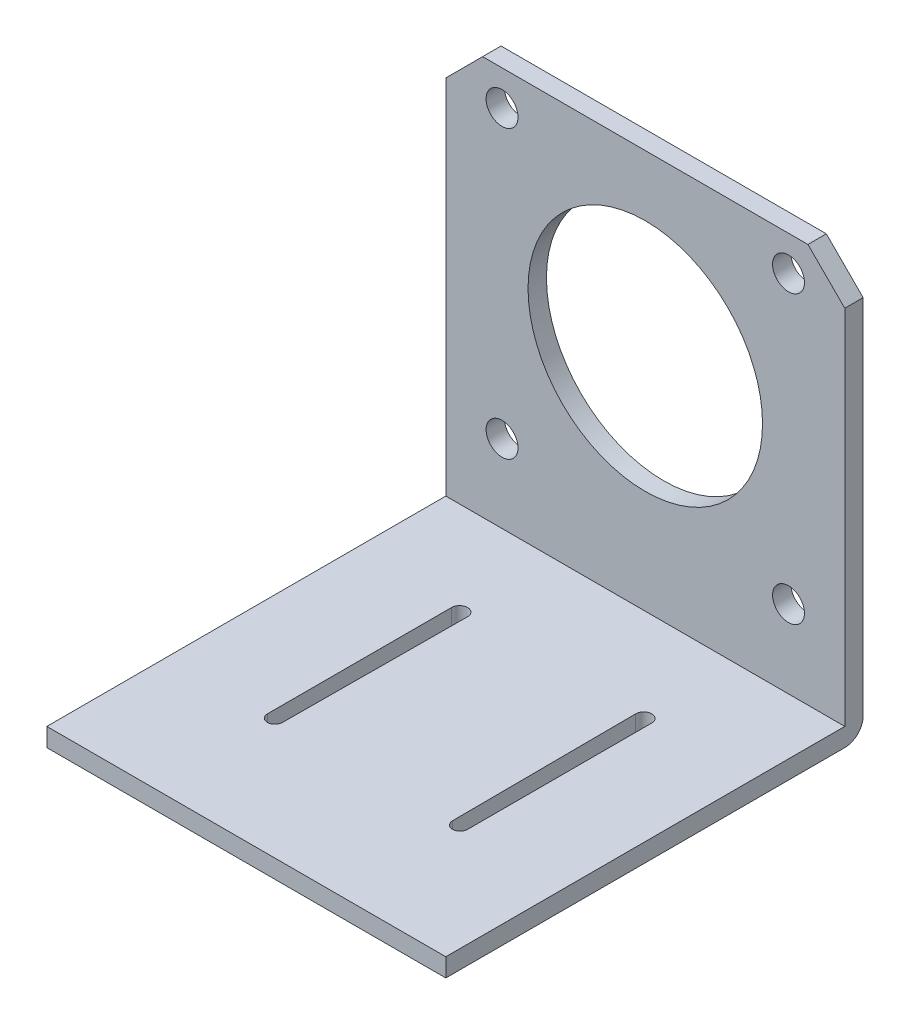
ISO-10303-21;
HEADER;
FILE_DESCRIPTION(('STEP AP214'),'2;1');
FILE_NAME('part.step','',(''),(''),'','','');
FILE_SCHEMA(('AUTOMOTIVE_DESIGN { 1 0 10303 214 1 1 1 1 }'));
ENDSEC;
DATA;
#1=APPLICATION_CONTEXT('core data for automotive mechanical design processes');
#2=APPLICATION_PROTOCOL_DEFINITION('international standard','automotive_design',2000,#1);
#3=PRODUCT_CONTEXT('',#1,'mechanical');
#4=PRODUCT('Part','Part','',(#3));
#5=PRODUCT_RELATED_PRODUCT_CATEGORY('part','',(#4));
#6=PRODUCT_DEFINITION_FORMATION('','',#4);
#7=PRODUCT_DEFINITION_CONTEXT('part definition',#1,'design');
#8=PRODUCT_DEFINITION('design','',#6,#7);
#9=PRODUCT_DEFINITION_SHAPE('','',#8);
#10=(LENGTH_UNIT() NAMED_UNIT(*) SI_UNIT(.MILLI.,.METRE.));
#11=(NAMED_UNIT(*) PLANE_ANGLE_UNIT() SI_UNIT($,.RADIAN.));
#12=(NAMED_UNIT(*) SI_UNIT($,.STERADIAN.) SOLID_ANGLE_UNIT());
#13=UNCERTAINTY_MEASURE_WITH_UNIT(LENGTH_MEASURE(1.E-05),#10,'distance_accuracy_value','');
#14=(GEOMETRIC_REPRESENTATION_CONTEXT(3) GLOBAL_UNCERTAINTY_ASSIGNED_CONTEXT((#13)) GLOBAL_UNIT_ASSIGNED_CONTEXT((#10,
#11,#12)) REPRESENTATION_CONTEXT('',''));
#15=CARTESIAN_POINT('',(0.,0.,0.));
#16=DIRECTION('',(0.,0.,1.));
#17=DIRECTION('',(1.,0.,0.));
#18=AXIS2_PLACEMENT_3D('',#15,#16,#17);
#19=CARTESIAN_POINT('',(-32.5,0.,-4.));
#20=DIRECTION('',(0.,1.,0.));
#21=DIRECTION('',(0.,0.,1.));
#22=AXIS2_PLACEMENT_3D('',#19,#20,#21);
#23=PLANE('',#22);
#24=DIRECTION('',(0.,0.,1.));
#25=VECTOR('',#24,1.);
#26=CARTESIAN_POINT('',(-16.3045351550092,0.,0.));
#27=LINE('',#26,#25);
#28=CARTESIAN_POINT('',(-16.3045351550092,0.,11.2535739083416));
#29=VERTEX_POINT('',#28);
#30=CARTESIAN_POINT('',(-16.3045351550092,0.,41.2535739083416));
#31=VERTEX_POINT('',#30);
#32=EDGE_CURVE('E51',#29,#31,#27,.T.);
#33=ORIENTED_EDGE('',*,*,#32,.F.);
#34=CARTESIAN_POINT('',(-15.,0.,11.2535739083416));
#35=DIRECTION('',(0.,1.,0.));
#36=DIRECTION('',(0.,0.,1.));
#37=AXIS2_PLACEMENT_3D('',#34,#35,#36);
#38=CIRCLE('',#37,1.30453515500922);
#39=CARTESIAN_POINT('',(-13.6954648449908,0.,11.2535739083416));
#40=VERTEX_POINT('',#39);
#41=EDGE_CURVE('E177',#40,#29,#38,.T.);
#42=ORIENTED_EDGE('',*,*,#41,.F.);
#43=DIRECTION('',(-0.00557165884833566,0.,0.999984478188376));
#44=VECTOR('',#43,1.);
#45=CARTESIAN_POINT('',(-13.632339590032,0.,-0.0759559244738696));
#46=LINE('',#45,#44);
#47=CARTESIAN_POINT('',(-13.8626172049483,0.,41.2535739083416));
#48=VERTEX_POINT('',#47);
#49=EDGE_CURVE('E161',#40,#48,#46,.T.);
#50=ORIENTED_EDGE('',*,*,#49,.T.);
#51=CARTESIAN_POINT('',(-15.0835761799788,0.,41.2535739083416));
#52=DIRECTION('',(0.,1.,0.));
#53=DIRECTION('',(0.,0.,1.));
#54=AXIS2_PLACEMENT_3D('',#51,#52,#53);
#55=CIRCLE('',#54,1.22095897503046);
#56=EDGE_CURVE('E171',#31,#48,#55,.T.);
#57=ORIENTED_EDGE('',*,*,#56,.F.);
#58=EDGE_LOOP('',(#33,#42,#50,#57));
#59=FACE_BOUND('',#58,.T.);
#60=DIRECTION('',(1.,0.,0.));
#61=VECTOR('',#60,1.);
#62=CARTESIAN_POINT('',(-32.5,0.,61.));
#63=LINE('',#62,#61);
#64=CARTESIAN_POINT('',(-32.5,0.,61.));
#65=VERTEX_POINT('',#64);
#66=CARTESIAN_POINT('',(32.5,0.,61.));
#67=VERTEX_POINT('',#66);
#68=EDGE_CURVE('E275',#65,#67,#63,.T.);
#69=ORIENTED_EDGE('',*,*,#68,.T.);
#70=DIRECTION('',(0.,0.,1.));
#71=VECTOR('',#70,1.);
#72=CARTESIAN_POINT('',(32.5,0.,-4.));
#73=LINE('',#72,#71);
#74=CARTESIAN_POINT('',(32.5,0.,-4.));
#75=VERTEX_POINT('',#74);
#76=EDGE_CURVE('E247',#75,#67,#73,.T.);
#77=ORIENTED_EDGE('',*,*,#76,.F.);
#78=DIRECTION('',(1.,0.,0.));
#79=VECTOR('',#78,1.);
#80=CARTESIAN_POINT('',(-32.5,0.,-4.));
#81=LINE('',#80,#79);
#82=CARTESIAN_POINT('',(-32.5,0.,-4.));
#83=VERTEX_POINT('',#82);
#84=EDGE_CURVE('E276',#83,#75,#81,.T.);
#85=ORIENTED_EDGE('',*,*,#84,.F.);
#86=DIRECTION('',(0.,0.,1.));
#87=VECTOR('',#86,1.);
#88=CARTESIAN_POINT('',(-32.5,0.,-4.));
#89=LINE('',#88,#87);
#90=EDGE_CURVE('E261',#83,#65,#89,.T.);
#91=ORIENTED_EDGE('',*,*,#90,.T.);
#92=EDGE_LOOP('',(#69,#77,#85,#91));
#93=FACE_BOUND('',#92,.T.);
#94=DIRECTION('',(0.00557165884833601,0.,0.999984478188376));
#95=VECTOR('',#94,1.);
#96=CARTESIAN_POINT('',(13.632339590032,0.,-0.0759559244738743));
#97=LINE('',#96,#95);
#98=CARTESIAN_POINT('',(13.6954648449908,0.,11.2535739083416));
#99=VERTEX_POINT('',#98);
#100=CARTESIAN_POINT('',(13.8626172049483,0.,41.2535739083416));
#101=VERTEX_POINT('',#100);
#102=EDGE_CURVE('E188',#99,#101,#97,.T.);
#103=ORIENTED_EDGE('',*,*,#102,.F.);
#104=CARTESIAN_POINT('',(15.,0.,11.2535739083416));
#105=DIRECTION('',(0.,1.,0.));
#106=DIRECTION('',(0.,0.,1.));
#107=AXIS2_PLACEMENT_3D('',#104,#105,#106);
#108=CIRCLE('',#107,1.30453515500922);
#109=CARTESIAN_POINT('',(16.3045351550092,0.,11.2535739083416));
#110=VERTEX_POINT('',#109);
#111=EDGE_CURVE('E59',#99,#110,#108,.F.);
#112=ORIENTED_EDGE('',*,*,#111,.T.);
#113=DIRECTION('',(0.,0.,1.));
#114=VECTOR('',#113,1.);
#115=CARTESIAN_POINT('',(16.3045351550092,0.,0.));
#116=LINE('',#115,#114);
#117=CARTESIAN_POINT('',(16.3045351550092,0.,41.2535739083416));
#118=VERTEX_POINT('',#117);
#119=EDGE_CURVE('E194',#110,#118,#116,.T.);
#120=ORIENTED_EDGE('',*,*,#119,.T.);
#121=CARTESIAN_POINT('',(15.0835761799788,0.,41.2535739083416));
#122=DIRECTION('',(0.,1.,0.));
#123=DIRECTION('',(0.,0.,1.));
#124=AXIS2_PLACEMENT_3D('',#121,#122,#123);
#125=CIRCLE('',#124,1.22095897503046);
#126=EDGE_CURVE('E191',#118,#101,#125,.F.);
#127=ORIENTED_EDGE('',*,*,#126,.T.);
#128=EDGE_LOOP('',(#103,#112,#120,#127));
#129=FACE_BOUND('',#128,.T.);
#130=ADVANCED_FACE('F36',(#59,#93,#129),#23,.T.);
#131=CARTESIAN_POINT('',(-32.5,-3.,-7.));
#132=DIRECTION('',(0.,-1.,0.));
#133=DIRECTION('',(0.,0.,-1.));
#134=AXIS2_PLACEMENT_3D('',#131,#132,#133);
#135=PLANE('',#134);
#136=DIRECTION('',(0.,0.,-1.));
#137=VECTOR('',#136,1.);
#138=CARTESIAN_POINT('',(-16.3045351550092,-3.,-7.));
#139=LINE('',#138,#137);
#140=CARTESIAN_POINT('',(-16.3045351550092,-3.00000000000001,41.2535739083416));
#141=VERTEX_POINT('',#140);
#142=CARTESIAN_POINT('',(-16.3045351550092,-3.,11.2535739083416));
#143=VERTEX_POINT('',#142);
#144=EDGE_CURVE('E12',#141,#143,#139,.T.);
#145=ORIENTED_EDGE('',*,*,#144,.F.);
#146=CARTESIAN_POINT('',(-15.0835761799788,-3.00000000000001,41.2535739083416));
#147=DIRECTION('',(0.,-1.,0.));
#148=DIRECTION('',(0.,0.,-1.));
#149=AXIS2_PLACEMENT_3D('',#146,#147,#148);
#150=CIRCLE('',#149,1.22095897503046);
#151=CARTESIAN_POINT('',(-13.8626172049483,-3.00000000000001,41.2535739083416));
#152=VERTEX_POINT('',#151);
#153=EDGE_CURVE('E313',#152,#141,#150,.T.);
#154=ORIENTED_EDGE('',*,*,#153,.F.);
#155=DIRECTION('',(0.00557165884833566,0.,-0.999984478188376));
#156=VECTOR('',#155,1.);
#157=CARTESIAN_POINT('',(-13.5943474933948,-3.,-6.89466251889947));
#158=LINE('',#157,#156);
#159=CARTESIAN_POINT('',(-13.6954648449908,-3.,11.2535739083416));
#160=VERTEX_POINT('',#159);
#161=EDGE_CURVE('E164',#152,#160,#158,.T.);
#162=ORIENTED_EDGE('',*,*,#161,.T.);
#163=CARTESIAN_POINT('',(-15.,-3.,11.2535739083416));
#164=DIRECTION('',(0.,-1.,0.));
#165=DIRECTION('',(0.,0.,-1.));
#166=AXIS2_PLACEMENT_3D('',#163,#164,#165);
#167=CIRCLE('',#166,1.30453515500922);
#168=EDGE_CURVE('E44',#143,#160,#167,.T.);
#169=ORIENTED_EDGE('',*,*,#168,.F.);
#170=EDGE_LOOP('',(#145,#154,#162,#169));
#171=FACE_BOUND('',#170,.T.);
#172=DIRECTION('',(0.,0.,-1.));
#173=VECTOR('',#172,1.);
#174=CARTESIAN_POINT('',(-32.5,-3.,-7.));
#175=LINE('',#174,#173);
#176=CARTESIAN_POINT('',(-32.5,-3.00000000000001,61.));
#177=VERTEX_POINT('',#176);
#178=CARTESIAN_POINT('',(-32.5,-3.,-4.));
#179=VERTEX_POINT('',#178);
#180=EDGE_CURVE('E267',#177,#179,#175,.T.);
#181=ORIENTED_EDGE('',*,*,#180,.T.);
#182=DIRECTION('',(1.,0.,0.));
#183=VECTOR('',#182,1.);
#184=CARTESIAN_POINT('',(-32.5,-3.,-4.));
#185=LINE('',#184,#183);
#186=CARTESIAN_POINT('',(32.5,-3.,-4.));
#187=VERTEX_POINT('',#186);
#188=EDGE_CURVE('E279',#179,#187,#185,.T.);
#189=ORIENTED_EDGE('',*,*,#188,.T.);
#190=DIRECTION('',(0.,0.,-1.));
#191=VECTOR('',#190,1.);
#192=CARTESIAN_POINT('',(32.5,-3.,-7.));
#193=LINE('',#192,#191);
#194=CARTESIAN_POINT('',(32.5,-3.00000000000001,61.));
#195=VERTEX_POINT('',#194);
#196=EDGE_CURVE('E253',#195,#187,#193,.T.);
#197=ORIENTED_EDGE('',*,*,#196,.F.);
#198=DIRECTION('',(1.,0.,0.));
#199=VECTOR('',#198,1.);
#200=CARTESIAN_POINT('',(-32.5,-3.00000000000001,61.));
#201=LINE('',#200,#199);
#202=EDGE_CURVE('E286',#177,#195,#201,.T.);
#203=ORIENTED_EDGE('',*,*,#202,.F.);
#204=EDGE_LOOP('',(#181,#189,#197,#203));
#205=FACE_BOUND('',#204,.T.);
#206=DIRECTION('',(0.,0.,-1.));
#207=VECTOR('',#206,1.);
#208=CARTESIAN_POINT('',(16.3045351550092,-3.,-7.));
#209=LINE('',#208,#207);
#210=CARTESIAN_POINT('',(16.3045351550092,-3.00000000000001,41.2535739083416));
#211=VERTEX_POINT('',#210);
#212=CARTESIAN_POINT('',(16.3045351550092,-3.,11.2535739083416));
#213=VERTEX_POINT('',#212);
#214=EDGE_CURVE('E307',#211,#213,#209,.T.);
#215=ORIENTED_EDGE('',*,*,#214,.T.);
#216=CARTESIAN_POINT('',(15.,-3.,11.2535739083416));
#217=DIRECTION('',(0.,-1.,0.));
#218=DIRECTION('',(0.,0.,-1.));
#219=AXIS2_PLACEMENT_3D('',#216,#217,#218);
#220=CIRCLE('',#219,1.30453515500922);
#221=CARTESIAN_POINT('',(13.6954648449908,-3.,11.2535739083416));
#222=VERTEX_POINT('',#221);
#223=EDGE_CURVE('E310',#213,#222,#220,.F.);
#224=ORIENTED_EDGE('',*,*,#223,.T.);
#225=DIRECTION('',(-0.00557165884833601,0.,-0.999984478188376));
#226=VECTOR('',#225,1.);
#227=CARTESIAN_POINT('',(13.5923296735438,-3.,-7.25681472269577));
#228=LINE('',#227,#226);
#229=CARTESIAN_POINT('',(13.8626172049483,-3.00000000000001,41.2535739083416));
#230=VERTEX_POINT('',#229);
#231=EDGE_CURVE('E302',#230,#222,#228,.T.);
#232=ORIENTED_EDGE('',*,*,#231,.F.);
#233=CARTESIAN_POINT('',(15.0835761799788,-3.00000000000001,41.2535739083416));
#234=DIRECTION('',(0.,-1.,0.));
#235=DIRECTION('',(0.,0.,-1.));
#236=AXIS2_PLACEMENT_3D('',#233,#234,#235);
#237=CIRCLE('',#236,1.22095897503046);
#238=EDGE_CURVE('E304',#230,#211,#237,.F.);
#239=ORIENTED_EDGE('',*,*,#238,.T.);
#240=EDGE_LOOP('',(#215,#224,#232,#239));
#241=FACE_BOUND('',#240,.T.);
#242=ADVANCED_FACE('F321',(#171,#205,#241),#135,.T.);
#243=CARTESIAN_POINT('',(-32.5,65.,-3.99999999999999));
#244=DIRECTION('',(0.,0.,1.));
#245=DIRECTION('',(0.,-1.,0.));
#246=AXIS2_PLACEMENT_3D('',#243,#244,#245);
#247=PLANE('',#246);
#248=CARTESIAN_POINT('',(23.3345237791557,12.6654762208442,-4.));
#249=DIRECTION('',(0.,0.,1.));
#250=DIRECTION('',(0.,-1.,0.));
#251=AXIS2_PLACEMENT_3D('',#248,#249,#250);
#252=CIRCLE('',#251,2.6);
#253=CARTESIAN_POINT('',(23.3345237791557,10.0654762208442,-4.));
#254=VERTEX_POINT('',#253);
#255=EDGE_CURVE('E244',#254,#254,#252,.T.);
#256=ORIENTED_EDGE('',*,*,#255,.F.);
#257=EDGE_LOOP('',(#256));
#258=FACE_BOUND('',#257,.T.);
#259=CARTESIAN_POINT('',(-23.3345237791565,12.6654762208444,-4.));
#260=DIRECTION('',(0.,0.,1.));
#261=DIRECTION('',(0.,-1.,0.));
#262=AXIS2_PLACEMENT_3D('',#259,#260,#261);
#263=CIRCLE('',#262,2.6);
#264=CARTESIAN_POINT('',(-23.3345237791565,10.0654762208444,-4.));
#265=VERTEX_POINT('',#264);
#266=EDGE_CURVE('E241',#265,#265,#263,.T.);
#267=ORIENTED_EDGE('',*,*,#266,.F.);
#268=EDGE_LOOP('',(#267));
#269=FACE_BOUND('',#268,.T.);
#270=CARTESIAN_POINT('',(-23.3345237791562,59.3345237791566,-3.99999999999999));
#271=DIRECTION('',(0.,0.,1.));
#272=DIRECTION('',(0.,-1.,0.));
#273=AXIS2_PLACEMENT_3D('',#270,#271,#272);
#274=CIRCLE('',#273,2.6);
#275=CARTESIAN_POINT('',(-23.3345237791562,56.7345237791566,-3.99999999999999));
#276=VERTEX_POINT('',#275);
#277=EDGE_CURVE('E238',#276,#276,#274,.T.);
#278=ORIENTED_EDGE('',*,*,#277,.F.);
#279=EDGE_LOOP('',(#278));
#280=FACE_BOUND('',#279,.T.);
#281=DIRECTION('',(0.707106781186548,0.707106781186548,0.));
#282=VECTOR('',#281,1.);
#283=CARTESIAN_POINT('',(-29.5,62.,-3.99999999999999));
#284=LINE('',#283,#282);
#285=CARTESIAN_POINT('',(-32.5,59.,-4.));
#286=VERTEX_POINT('',#285);
#287=CARTESIAN_POINT('',(-26.5,65.,-3.99999999999999));
#288=VERTEX_POINT('',#287);
#289=EDGE_CURVE('E230',#286,#288,#284,.T.);
#290=ORIENTED_EDGE('',*,*,#289,.F.);
#291=DIRECTION('',(0.,-1.,0.));
#292=VECTOR('',#291,1.);
#293=CARTESIAN_POINT('',(-32.5,65.,-3.99999999999999));
#294=LINE('',#293,#292);
#295=EDGE_CURVE('E273',#286,#83,#294,.T.);
#296=ORIENTED_EDGE('',*,*,#295,.T.);
#297=ORIENTED_EDGE('',*,*,#84,.T.);
#298=DIRECTION('',(0.,-1.,0.));
#299=VECTOR('',#298,1.);
#300=CARTESIAN_POINT('',(32.5,65.,-3.99999999999999));
#301=LINE('',#300,#299);
#302=CARTESIAN_POINT('',(32.5,59.,-3.99999999999999));
#303=VERTEX_POINT('',#302);
#304=EDGE_CURVE('E259',#303,#75,#301,.T.);
#305=ORIENTED_EDGE('',*,*,#304,.F.);
#306=DIRECTION('',(0.707106781186548,-0.707106781186548,0.));
#307=VECTOR('',#306,1.);
#308=CARTESIAN_POINT('',(-3.,94.5,-3.99999999999999));
#309=LINE('',#308,#307);
#310=CARTESIAN_POINT('',(26.5,65.,-3.99999999999999));
#311=VERTEX_POINT('',#310);
#312=EDGE_CURVE('E228',#311,#303,#309,.T.);
#313=ORIENTED_EDGE('',*,*,#312,.F.);
#314=DIRECTION('',(1.,0.,0.));
#315=VECTOR('',#314,1.);
#316=CARTESIAN_POINT('',(-32.5,65.,-3.99999999999999));
#317=LINE('',#316,#315);
#318=EDGE_CURVE('E280',#288,#311,#317,.T.);
#319=ORIENTED_EDGE('',*,*,#318,.F.);
#320=EDGE_LOOP('',(#290,#296,#297,#305,#313,#319));
#321=FACE_BOUND('',#320,.T.);
#322=CARTESIAN_POINT('',(23.334523779156,59.3345237791561,-3.99999999999999));
#323=DIRECTION('',(0.,0.,1.));
#324=DIRECTION('',(0.,-1.,0.));
#325=AXIS2_PLACEMENT_3D('',#322,#323,#324);
#326=CIRCLE('',#325,2.6);
#327=CARTESIAN_POINT('',(23.334523779156,56.7345237791561,-3.99999999999999));
#328=VERTEX_POINT('',#327);
#329=EDGE_CURVE('E235',#328,#328,#326,.T.);
#330=ORIENTED_EDGE('',*,*,#329,.F.);
#331=EDGE_LOOP('',(#330));
#332=FACE_BOUND('',#331,.T.);
#333=CARTESIAN_POINT('',(0.,36.,-3.99999999999999));
#334=DIRECTION('',(0.,0.,1.));
#335=DIRECTION('',(0.,-1.,0.));
#336=AXIS2_PLACEMENT_3D('',#333,#334,#335);
#337=CIRCLE('',#336,19.1);
#338=CARTESIAN_POINT('',(0.,16.9,-4.));
#339=VERTEX_POINT('',#338);
#340=EDGE_CURVE('E232',#339,#339,#337,.T.);
#341=ORIENTED_EDGE('',*,*,#340,.F.);
#342=EDGE_LOOP('',(#341));
#343=FACE_BOUND('',#342,.T.);
#344=ADVANCED_FACE('F341',(#258,#269,#280,#321,#332,#343),#247,.T.);
#345=CARTESIAN_POINT('',(-32.5,65.,-6.99999999999999));
#346=DIRECTION('',(0.,1.,0.));
#347=DIRECTION('',(0.,0.,1.));
#348=AXIS2_PLACEMENT_3D('',#345,#346,#347);
#349=PLANE('',#348);
#350=DIRECTION('',(0.,0.,-1.));
#351=VECTOR('',#350,1.);
#352=CARTESIAN_POINT('',(-26.5,65.,6.12500000000001));
#353=LINE('',#352,#351);
#354=CARTESIAN_POINT('',(-26.5,65.,-6.99999999999999));
#355=VERTEX_POINT('',#354);
#356=EDGE_CURVE('E212',#288,#355,#353,.T.);
#357=ORIENTED_EDGE('',*,*,#356,.F.);
#358=ORIENTED_EDGE('',*,*,#318,.T.);
#359=DIRECTION('',(0.,0.,-1.));
#360=VECTOR('',#359,1.);
#361=CARTESIAN_POINT('',(26.5,65.,6.12500000000001));
#362=LINE('',#361,#360);
#363=CARTESIAN_POINT('',(26.5,65.,-6.99999999999999));
#364=VERTEX_POINT('',#363);
#365=EDGE_CURVE('E209',#311,#364,#362,.T.);
#366=ORIENTED_EDGE('',*,*,#365,.T.);
#367=DIRECTION('',(1.,0.,0.));
#368=VECTOR('',#367,1.);
#369=CARTESIAN_POINT('',(-32.5,65.,-6.99999999999999));
#370=LINE('',#369,#368);
#371=EDGE_CURVE('E283',#355,#364,#370,.T.);
#372=ORIENTED_EDGE('',*,*,#371,.F.);
#373=EDGE_LOOP('',(#357,#358,#366,#372));
#374=FACE_BOUND('',#373,.T.);
#375=ADVANCED_FACE('F352',(#374),#349,.T.);
#376=CARTESIAN_POINT('',(-32.5,65.,-6.99999999999999));
#377=DIRECTION('',(0.,0.,-1.));
#378=DIRECTION('',(0.,1.,0.));
#379=AXIS2_PLACEMENT_3D('',#376,#377,#378);
#380=PLANE('',#379);
#381=CARTESIAN_POINT('',(23.3345237791557,12.6654762208442,-7.));
#382=DIRECTION('',(0.,0.,-1.));
#383=DIRECTION('',(0.,1.,0.));
#384=AXIS2_PLACEMENT_3D('',#381,#382,#383);
#385=CIRCLE('',#384,2.6);
#386=CARTESIAN_POINT('',(23.3345237791557,15.2654762208442,-7.));
#387=VERTEX_POINT('',#386);
#388=EDGE_CURVE('E184',#387,#387,#385,.T.);
#389=ORIENTED_EDGE('',*,*,#388,.F.);
#390=EDGE_LOOP('',(#389));
#391=FACE_BOUND('',#390,.T.);
#392=CARTESIAN_POINT('',(-23.3345237791565,12.6654762208444,-7.));
#393=DIRECTION('',(0.,0.,-1.));
#394=DIRECTION('',(0.,1.,0.));
#395=AXIS2_PLACEMENT_3D('',#392,#393,#394);
#396=CIRCLE('',#395,2.6);
#397=CARTESIAN_POINT('',(-23.3345237791565,15.2654762208444,-7.));
#398=VERTEX_POINT('',#397);
#399=EDGE_CURVE('E221',#398,#398,#396,.T.);
#400=ORIENTED_EDGE('',*,*,#399,.F.);
#401=EDGE_LOOP('',(#400));
#402=FACE_BOUND('',#401,.T.);
#403=CARTESIAN_POINT('',(-23.3345237791562,59.3345237791566,-6.99999999999999));
#404=DIRECTION('',(0.,0.,-1.));
#405=DIRECTION('',(0.,1.,0.));
#406=AXIS2_PLACEMENT_3D('',#403,#404,#405);
#407=CIRCLE('',#406,2.6);
#408=CARTESIAN_POINT('',(-23.3345237791562,61.9345237791566,-6.99999999999999));
#409=VERTEX_POINT('',#408);
#410=EDGE_CURVE('E217',#409,#409,#407,.T.);
#411=ORIENTED_EDGE('',*,*,#410,.F.);
#412=EDGE_LOOP('',(#411));
#413=FACE_BOUND('',#412,.T.);
#414=DIRECTION('',(-0.707106781186548,-0.707106781186548,0.));
#415=VECTOR('',#414,1.);
#416=CARTESIAN_POINT('',(-26.5,65.,-6.99999999999999));
#417=LINE('',#416,#415);
#418=CARTESIAN_POINT('',(-32.5,59.,-6.99999999999999));
#419=VERTEX_POINT('',#418);
#420=EDGE_CURVE('E215',#355,#419,#417,.T.);
#421=ORIENTED_EDGE('',*,*,#420,.F.);
#422=ORIENTED_EDGE('',*,*,#371,.T.);
#423=DIRECTION('',(-0.707106781186548,0.707106781186548,0.));
#424=VECTOR('',#423,1.);
#425=CARTESIAN_POINT('',(26.5,65.,-6.99999999999999));
#426=LINE('',#425,#424);
#427=CARTESIAN_POINT('',(32.5,59.,-6.99999999999999));
#428=VERTEX_POINT('',#427);
#429=EDGE_CURVE('E210',#428,#364,#426,.T.);
#430=ORIENTED_EDGE('',*,*,#429,.F.);
#431=DIRECTION('',(0.,1.,0.));
#432=VECTOR('',#431,1.);
#433=CARTESIAN_POINT('',(32.5,65.,-6.99999999999999));
#434=LINE('',#433,#432);
#435=CARTESIAN_POINT('',(32.5,0.,-7.));
#436=VERTEX_POINT('',#435);
#437=EDGE_CURVE('E256',#436,#428,#434,.T.);
#438=ORIENTED_EDGE('',*,*,#437,.F.);
#439=DIRECTION('',(1.,0.,0.));
#440=VECTOR('',#439,1.);
#441=CARTESIAN_POINT('',(-32.5,0.,-7.));
#442=LINE('',#441,#440);
#443=CARTESIAN_POINT('',(-32.5,0.,-7.));
#444=VERTEX_POINT('',#443);
#445=EDGE_CURVE('E293',#436,#444,#442,.F.);
#446=ORIENTED_EDGE('',*,*,#445,.T.);
#447=DIRECTION('',(0.,1.,0.));
#448=VECTOR('',#447,1.);
#449=CARTESIAN_POINT('',(-32.5,65.,-6.99999999999999));
#450=LINE('',#449,#448);
#451=EDGE_CURVE('E270',#444,#419,#450,.T.);
#452=ORIENTED_EDGE('',*,*,#451,.T.);
#453=EDGE_LOOP('',(#421,#422,#430,#438,#446,#452));
#454=FACE_BOUND('',#453,.T.);
#455=CARTESIAN_POINT('',(23.334523779156,59.3345237791561,-6.99999999999999));
#456=DIRECTION('',(0.,0.,-1.));
#457=DIRECTION('',(0.,1.,0.));
#458=AXIS2_PLACEMENT_3D('',#455,#456,#457);
#459=CIRCLE('',#458,2.6);
#460=CARTESIAN_POINT('',(23.334523779156,61.9345237791561,-6.99999999999999));
#461=VERTEX_POINT('',#460);
#462=EDGE_CURVE('E205',#461,#461,#459,.T.);
#463=ORIENTED_EDGE('',*,*,#462,.F.);
#464=EDGE_LOOP('',(#463));
#465=FACE_BOUND('',#464,.T.);
#466=CARTESIAN_POINT('',(0.,36.,-7.));
#467=DIRECTION('',(0.,0.,-1.));
#468=DIRECTION('',(0.,1.,0.));
#469=AXIS2_PLACEMENT_3D('',#466,#467,#468);
#470=CIRCLE('',#469,19.1);
#471=CARTESIAN_POINT('',(0.,55.1,-6.99999999999999));
#472=VERTEX_POINT('',#471);
#473=EDGE_CURVE('E208',#472,#472,#470,.T.);
#474=ORIENTED_EDGE('',*,*,#473,.F.);
#475=EDGE_LOOP('',(#474));
#476=FACE_BOUND('',#475,.T.);
#477=ADVANCED_FACE('F347',(#391,#402,#413,#454,#465,#476),#380,.T.);
#478=CARTESIAN_POINT('',(-32.5,-3.00000000000001,61.));
#479=DIRECTION('',(0.,0.,1.));
#480=DIRECTION('',(1.,0.,0.));
#481=AXIS2_PLACEMENT_3D('',#478,#479,#480);
#482=PLANE('',#481);
#483=ORIENTED_EDGE('',*,*,#202,.T.);
#484=DIRECTION('',(0.,-1.,0.));
#485=VECTOR('',#484,1.);
#486=CARTESIAN_POINT('',(32.5,-3.00000000000001,61.));
#487=LINE('',#486,#485);
#488=EDGE_CURVE('E250',#67,#195,#487,.T.);
#489=ORIENTED_EDGE('',*,*,#488,.F.);
#490=ORIENTED_EDGE('',*,*,#68,.F.);
#491=DIRECTION('',(0.,-1.,0.));
#492=VECTOR('',#491,1.);
#493=CARTESIAN_POINT('',(-32.5,-3.00000000000001,61.));
#494=LINE('',#493,#492);
#495=EDGE_CURVE('E264',#65,#177,#494,.T.);
#496=ORIENTED_EDGE('',*,*,#495,.T.);
#497=EDGE_LOOP('',(#483,#489,#490,#496));
#498=FACE_BOUND('',#497,.T.);
#499=ADVANCED_FACE('F344',(#498),#482,.T.);
#500=CARTESIAN_POINT('',(-32.5,0.,0.));
#501=DIRECTION('',(-1.,0.,0.));
#502=DIRECTION('',(0.,0.,1.));
#503=AXIS2_PLACEMENT_3D('',#500,#501,#502);
#504=PLANE('',#503);
#505=DIRECTION('',(0.,0.,1.));
#506=VECTOR('',#505,1.);
#507=CARTESIAN_POINT('',(-32.5,59.,0.));
#508=LINE('',#507,#506);
#509=EDGE_CURVE('E300',#419,#286,#508,.T.);
#510=ORIENTED_EDGE('',*,*,#509,.F.);
#511=ORIENTED_EDGE('',*,*,#451,.F.);
#512=CARTESIAN_POINT('',(-32.5,0.,-4.));
#513=DIRECTION('',(-1.,0.,0.));
#514=DIRECTION('',(0.,0.,1.));
#515=AXIS2_PLACEMENT_3D('',#512,#513,#514);
#516=CIRCLE('',#515,3.);
#517=EDGE_CURVE('E295',#444,#179,#516,.T.);
#518=ORIENTED_EDGE('',*,*,#517,.T.);
#519=ORIENTED_EDGE('',*,*,#180,.F.);
#520=ORIENTED_EDGE('',*,*,#495,.F.);
#521=ORIENTED_EDGE('',*,*,#90,.F.);
#522=ORIENTED_EDGE('',*,*,#295,.F.);
#523=EDGE_LOOP('',(#510,#511,#518,#519,#520,#521,#522));
#524=FACE_BOUND('',#523,.T.);
#525=ADVANCED_FACE('F346',(#524),#504,.T.);
#526=CARTESIAN_POINT('',(32.5,0.,0.));
#527=DIRECTION('',(-1.,0.,0.));
#528=DIRECTION('',(0.,0.,1.));
#529=AXIS2_PLACEMENT_3D('',#526,#527,#528);
#530=PLANE('',#529);
#531=ORIENTED_EDGE('',*,*,#437,.T.);
#532=DIRECTION('',(0.,0.,1.));
#533=VECTOR('',#532,1.);
#534=CARTESIAN_POINT('',(32.5,59.,0.));
#535=LINE('',#534,#533);
#536=EDGE_CURVE('E297',#428,#303,#535,.T.);
#537=ORIENTED_EDGE('',*,*,#536,.T.);
#538=ORIENTED_EDGE('',*,*,#304,.T.);
#539=ORIENTED_EDGE('',*,*,#76,.T.);
#540=ORIENTED_EDGE('',*,*,#488,.T.);
#541=ORIENTED_EDGE('',*,*,#196,.T.);
#542=CARTESIAN_POINT('',(32.5,0.,-4.));
#543=DIRECTION('',(-1.,0.,0.));
#544=DIRECTION('',(0.,0.,1.));
#545=AXIS2_PLACEMENT_3D('',#542,#543,#544);
#546=CIRCLE('',#545,3.);
#547=EDGE_CURVE('E291',#187,#436,#546,.F.);
#548=ORIENTED_EDGE('',*,*,#547,.T.);
#549=EDGE_LOOP('',(#531,#537,#538,#539,#540,#541,#548));
#550=FACE_BOUND('',#549,.T.);
#551=ADVANCED_FACE('F362',(#550),#530,.F.);
#552=CARTESIAN_POINT('',(-32.5,0.,-4.));
#553=DIRECTION('',(1.,0.,0.));
#554=DIRECTION('',(0.,0.,-1.));
#555=AXIS2_PLACEMENT_3D('',#552,#553,#554);
#556=CYLINDRICAL_SURFACE('',#555,3.);
#557=ORIENTED_EDGE('',*,*,#517,.F.);
#558=ORIENTED_EDGE('',*,*,#445,.F.);
#559=ORIENTED_EDGE('',*,*,#547,.F.);
#560=ORIENTED_EDGE('',*,*,#188,.F.);
#561=EDGE_LOOP('',(#557,#558,#559,#560));
#562=FACE_BOUND('',#561,.T.);
#563=ADVANCED_FACE('F38',(#562),#556,.T.);
#564=CARTESIAN_POINT('',(26.5,65.,6.12500000000001));
#565=DIRECTION('',(-0.707106781186548,-0.707106781186548,0.));
#566=DIRECTION('',(0.707106781186548,-0.707106781186548,0.));
#567=AXIS2_PLACEMENT_3D('',#564,#565,#566);
#568=PLANE('',#567);
#569=ORIENTED_EDGE('',*,*,#312,.T.);
#570=ORIENTED_EDGE('',*,*,#536,.F.);
#571=ORIENTED_EDGE('',*,*,#429,.T.);
#572=ORIENTED_EDGE('',*,*,#365,.F.);
#573=EDGE_LOOP('',(#569,#570,#571,#572));
#574=FACE_BOUND('',#573,.T.);
#575=ADVANCED_FACE('F388',(#574),#568,.F.);
#576=CARTESIAN_POINT('',(-26.5,65.,6.12500000000001));
#577=DIRECTION('',(0.707106781186548,-0.707106781186548,0.));
#578=DIRECTION('',(0.707106781186548,0.707106781186548,0.));
#579=AXIS2_PLACEMENT_3D('',#576,#577,#578);
#580=PLANE('',#579);
#581=ORIENTED_EDGE('',*,*,#289,.T.);
#582=ORIENTED_EDGE('',*,*,#356,.T.);
#583=ORIENTED_EDGE('',*,*,#420,.T.);
#584=ORIENTED_EDGE('',*,*,#509,.T.);
#585=EDGE_LOOP('',(#581,#582,#583,#584));
#586=FACE_BOUND('',#585,.T.);
#587=ADVANCED_FACE('F371',(#586),#580,.F.);
#588=CARTESIAN_POINT('',(0.,36.,6.125));
#589=DIRECTION('',(0.,0.,-1.));
#590=DIRECTION('',(0.,1.,0.));
#591=AXIS2_PLACEMENT_3D('',#588,#589,#590);
#592=CYLINDRICAL_SURFACE('',#591,19.1);
#593=ORIENTED_EDGE('',*,*,#340,.T.);
#594=EDGE_LOOP('',(#593));
#595=FACE_BOUND('',#594,.T.);
#596=ORIENTED_EDGE('',*,*,#473,.T.);
#597=EDGE_LOOP('',(#596));
#598=FACE_BOUND('',#597,.T.);
#599=ADVANCED_FACE('F367',(#595,#598),#592,.F.);
#600=CARTESIAN_POINT('',(23.334523779156,59.3345237791561,6.12500000000001));
#601=DIRECTION('',(0.,0.,-1.));
#602=DIRECTION('',(0.,1.,0.));
#603=AXIS2_PLACEMENT_3D('',#600,#601,#602);
#604=CYLINDRICAL_SURFACE('',#603,2.6);
#605=ORIENTED_EDGE('',*,*,#329,.T.);
#606=EDGE_LOOP('',(#605));
#607=FACE_BOUND('',#606,.T.);
#608=ORIENTED_EDGE('',*,*,#462,.T.);
#609=EDGE_LOOP('',(#608));
#610=FACE_BOUND('',#609,.T.);
#611=ADVANCED_FACE('F370',(#607,#610),#604,.F.);
#612=CARTESIAN_POINT('',(-23.3345237791562,59.3345237791566,6.12500000000001));
#613=DIRECTION('',(0.,0.,-1.));
#614=DIRECTION('',(0.,1.,0.));
#615=AXIS2_PLACEMENT_3D('',#612,#613,#614);
#616=CYLINDRICAL_SURFACE('',#615,2.6);
#617=ORIENTED_EDGE('',*,*,#277,.T.);
#618=EDGE_LOOP('',(#617));
#619=FACE_BOUND('',#618,.T.);
#620=ORIENTED_EDGE('',*,*,#410,.T.);
#621=EDGE_LOOP('',(#620));
#622=FACE_BOUND('',#621,.T.);
#623=ADVANCED_FACE('F381',(#619,#622),#616,.F.);
#624=CARTESIAN_POINT('',(-23.3345237791565,12.6654762208444,6.125));
#625=DIRECTION('',(0.,0.,-1.));
#626=DIRECTION('',(0.,1.,0.));
#627=AXIS2_PLACEMENT_3D('',#624,#625,#626);
#628=CYLINDRICAL_SURFACE('',#627,2.6);
#629=ORIENTED_EDGE('',*,*,#266,.T.);
#630=EDGE_LOOP('',(#629));
#631=FACE_BOUND('',#630,.T.);
#632=ORIENTED_EDGE('',*,*,#399,.T.);
#633=EDGE_LOOP('',(#632));
#634=FACE_BOUND('',#633,.T.);
#635=ADVANCED_FACE('F377',(#631,#634),#628,.F.);
#636=CARTESIAN_POINT('',(23.3345237791557,12.6654762208442,6.125));
#637=DIRECTION('',(0.,0.,-1.));
#638=DIRECTION('',(0.,1.,0.));
#639=AXIS2_PLACEMENT_3D('',#636,#637,#638);
#640=CYLINDRICAL_SURFACE('',#639,2.6);
#641=ORIENTED_EDGE('',*,*,#255,.T.);
#642=EDGE_LOOP('',(#641));
#643=FACE_BOUND('',#642,.T.);
#644=ORIENTED_EDGE('',*,*,#388,.T.);
#645=EDGE_LOOP('',(#644));
#646=FACE_BOUND('',#645,.T.);
#647=ADVANCED_FACE('F373',(#643,#646),#640,.F.);
#648=CARTESIAN_POINT('',(15.,-10.,11.2535739083416));
#649=DIRECTION('',(0.,1.,0.));
#650=DIRECTION('',(0.,0.,1.));
#651=AXIS2_PLACEMENT_3D('',#648,#649,#650);
#652=CYLINDRICAL_SURFACE('',#651,1.30453515500922);
#653=DIRECTION('',(0.,1.,0.));
#654=VECTOR('',#653,1.);
#655=CARTESIAN_POINT('',(16.3045351550092,-10.,11.2535739083416));
#656=LINE('',#655,#654);
#657=EDGE_CURVE('E198',#213,#110,#656,.T.);
#658=ORIENTED_EDGE('',*,*,#657,.T.);
#659=ORIENTED_EDGE('',*,*,#111,.F.);
#660=DIRECTION('',(0.,1.,0.));
#661=VECTOR('',#660,1.);
#662=CARTESIAN_POINT('',(13.6954648449908,-10.,11.2535739083416));
#663=LINE('',#662,#661);
#664=EDGE_CURVE('E197',#222,#99,#663,.T.);
#665=ORIENTED_EDGE('',*,*,#664,.F.);
#666=ORIENTED_EDGE('',*,*,#223,.F.);
#667=EDGE_LOOP('',(#658,#659,#665,#666));
#668=FACE_BOUND('',#667,.T.);
#669=ADVANCED_FACE('F376',(#668),#652,.F.);
#670=CARTESIAN_POINT('',(16.3045351550092,-10.,0.));
#671=DIRECTION('',(-1.,0.,0.));
#672=DIRECTION('',(0.,0.,1.));
#673=AXIS2_PLACEMENT_3D('',#670,#671,#672);
#674=PLANE('',#673);
#675=DIRECTION('',(0.,1.,0.));
#676=VECTOR('',#675,1.);
#677=CARTESIAN_POINT('',(16.3045351550092,-10.,41.2535739083416));
#678=LINE('',#677,#676);
#679=EDGE_CURVE('E200',#211,#118,#678,.T.);
#680=ORIENTED_EDGE('',*,*,#679,.T.);
#681=ORIENTED_EDGE('',*,*,#119,.F.);
#682=ORIENTED_EDGE('',*,*,#657,.F.);
#683=ORIENTED_EDGE('',*,*,#214,.F.);
#684=EDGE_LOOP('',(#680,#681,#682,#683));
#685=FACE_BOUND('',#684,.T.);
#686=ADVANCED_FACE('F397',(#685),#674,.T.);
#687=CARTESIAN_POINT('',(15.0835761799788,-10.,41.2535739083416));
#688=DIRECTION('',(0.,1.,0.));
#689=DIRECTION('',(0.,0.,1.));
#690=AXIS2_PLACEMENT_3D('',#687,#688,#689);
#691=CYLINDRICAL_SURFACE('',#690,1.22095897503046);
#692=DIRECTION('',(0.,1.,0.));
#693=VECTOR('',#692,1.);
#694=CARTESIAN_POINT('',(13.8626172049483,-10.,41.2535739083416));
#695=LINE('',#694,#693);
#696=EDGE_CURVE('E202',#230,#101,#695,.T.);
#697=ORIENTED_EDGE('',*,*,#696,.T.);
#698=ORIENTED_EDGE('',*,*,#126,.F.);
#699=ORIENTED_EDGE('',*,*,#679,.F.);
#700=ORIENTED_EDGE('',*,*,#238,.F.);
#701=EDGE_LOOP('',(#697,#698,#699,#700));
#702=FACE_BOUND('',#701,.T.);
#703=ADVANCED_FACE('F332',(#702),#691,.F.);
#704=CARTESIAN_POINT('',(13.632339590032,-10.,-0.0759559244738756));
#705=DIRECTION('',(-0.999984478188376,0.,0.00557165884833601));
#706=DIRECTION('',(0.00557165884833601,0.,0.999984478188376));
#707=AXIS2_PLACEMENT_3D('',#704,#705,#706);
#708=PLANE('',#707);
#709=ORIENTED_EDGE('',*,*,#231,.T.);
#710=ORIENTED_EDGE('',*,*,#664,.T.);
#711=ORIENTED_EDGE('',*,*,#102,.T.);
#712=ORIENTED_EDGE('',*,*,#696,.F.);
#713=EDGE_LOOP('',(#709,#710,#711,#712));
#714=FACE_BOUND('',#713,.T.);
#715=ADVANCED_FACE('F325',(#714),#708,.F.);
#716=CARTESIAN_POINT('',(-16.3045351550092,-10.,0.));
#717=DIRECTION('',(-1.,0.,0.));
#718=DIRECTION('',(0.,0.,1.));
#719=AXIS2_PLACEMENT_3D('',#716,#717,#718);
#720=PLANE('',#719);
#721=ORIENTED_EDGE('',*,*,#144,.T.);
#722=DIRECTION('',(0.,1.,0.));
#723=VECTOR('',#722,1.);
#724=CARTESIAN_POINT('',(-16.3045351550092,-10.,11.2535739083416));
#725=LINE('',#724,#723);
#726=EDGE_CURVE('E182',#143,#29,#725,.T.);
#727=ORIENTED_EDGE('',*,*,#726,.T.);
#728=ORIENTED_EDGE('',*,*,#32,.T.);
#729=DIRECTION('',(0.,1.,0.));
#730=VECTOR('',#729,1.);
#731=CARTESIAN_POINT('',(-16.3045351550092,-10.,41.2535739083416));
#732=LINE('',#731,#730);
#733=EDGE_CURVE('E168',#141,#31,#732,.T.);
#734=ORIENTED_EDGE('',*,*,#733,.F.);
#735=EDGE_LOOP('',(#721,#727,#728,#734));
#736=FACE_BOUND('',#735,.T.);
#737=ADVANCED_FACE('F323',(#736),#720,.F.);
#738=CARTESIAN_POINT('',(-15.,-10.,11.2535739083416));
#739=DIRECTION('',(0.,1.,0.));
#740=DIRECTION('',(0.,0.,1.));
#741=AXIS2_PLACEMENT_3D('',#738,#739,#740);
#742=CYLINDRICAL_SURFACE('',#741,1.30453515500922);
#743=ORIENTED_EDGE('',*,*,#168,.T.);
#744=DIRECTION('',(0.,1.,0.));
#745=VECTOR('',#744,1.);
#746=CARTESIAN_POINT('',(-13.6954648449908,-10.,11.2535739083416));
#747=LINE('',#746,#745);
#748=EDGE_CURVE('E167',#160,#40,#747,.T.);
#749=ORIENTED_EDGE('',*,*,#748,.T.);
#750=ORIENTED_EDGE('',*,*,#41,.T.);
#751=ORIENTED_EDGE('',*,*,#726,.F.);
#752=EDGE_LOOP('',(#743,#749,#750,#751));
#753=FACE_BOUND('',#752,.T.);
#754=ADVANCED_FACE('F318',(#753),#742,.F.);
#755=CARTESIAN_POINT('',(-13.632339590032,-10.,-0.0759559244738709));
#756=DIRECTION('',(-0.999984478188376,0.,-0.00557165884833566));
#757=DIRECTION('',(-0.00557165884833566,0.,0.999984478188376));
#758=AXIS2_PLACEMENT_3D('',#755,#756,#757);
#759=PLANE('',#758);
#760=DIRECTION('',(0.,1.,0.));
#761=VECTOR('',#760,1.);
#762=CARTESIAN_POINT('',(-13.8626172049483,-10.,41.2535739083416));
#763=LINE('',#762,#761);
#764=EDGE_CURVE('E156',#152,#48,#763,.T.);
#765=ORIENTED_EDGE('',*,*,#764,.T.);
#766=ORIENTED_EDGE('',*,*,#49,.F.);
#767=ORIENTED_EDGE('',*,*,#748,.F.);
#768=ORIENTED_EDGE('',*,*,#161,.F.);
#769=EDGE_LOOP('',(#765,#766,#767,#768));
#770=FACE_BOUND('',#769,.T.);
#771=ADVANCED_FACE('F158',(#770),#759,.T.);
#772=CARTESIAN_POINT('',(-15.0835761799788,-10.,41.2535739083416));
#773=DIRECTION('',(0.,1.,0.));
#774=DIRECTION('',(0.,0.,1.));
#775=AXIS2_PLACEMENT_3D('',#772,#773,#774);
#776=CYLINDRICAL_SURFACE('',#775,1.22095897503046);
#777=ORIENTED_EDGE('',*,*,#153,.T.);
#778=ORIENTED_EDGE('',*,*,#733,.T.);
#779=ORIENTED_EDGE('',*,*,#56,.T.);
#780=ORIENTED_EDGE('',*,*,#764,.F.);
#781=EDGE_LOOP('',(#777,#778,#779,#780));
#782=FACE_BOUND('',#781,.T.);
#783=ADVANCED_FACE('F172',(#782),#776,.F.);
#784=CLOSED_SHELL('',(#130,#242,#344,#375,#477,#499,#525,#551,#563,#575,#587,#599,#611,#623,
#635,#647,#669,#686,#703,#715,#737,#754,#771,#783));
#785=MANIFOLD_SOLID_BREP('B2',#784);
#786=ADVANCED_BREP_SHAPE_REPRESENTATION('',(#18,#785),#14);
#787=SHAPE_DEFINITION_REPRESENTATION(#9,#786);
ENDSEC;
END-ISO-10303-21;
